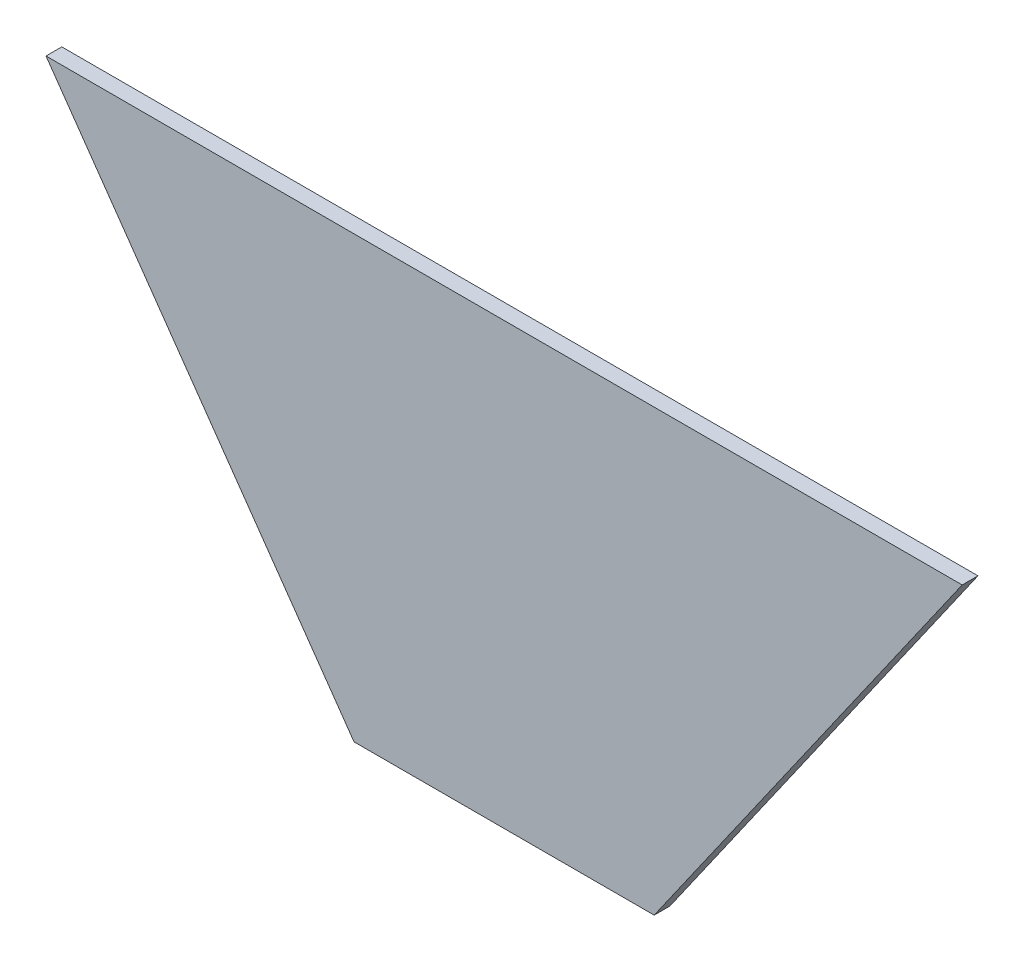
ISO-10303-21;
HEADER;
FILE_DESCRIPTION(('STEP AP214'),'2;1');
FILE_NAME('part.step','',(''),(''),'','','');
FILE_SCHEMA(('AUTOMOTIVE_DESIGN { 1 0 10303 214 1 1 1 1 }'));
ENDSEC;
DATA;
#1=APPLICATION_CONTEXT('core data for automotive mechanical design processes');
#2=APPLICATION_PROTOCOL_DEFINITION('international standard','automotive_design',2000,#1);
#3=PRODUCT_CONTEXT('',#1,'mechanical');
#4=PRODUCT('Part','Part','',(#3));
#5=PRODUCT_RELATED_PRODUCT_CATEGORY('part','',(#4));
#6=PRODUCT_DEFINITION_FORMATION('','',#4);
#7=PRODUCT_DEFINITION_CONTEXT('part definition',#1,'design');
#8=PRODUCT_DEFINITION('design','',#6,#7);
#9=PRODUCT_DEFINITION_SHAPE('','',#8);
#10=(LENGTH_UNIT() NAMED_UNIT(*) SI_UNIT(.MILLI.,.METRE.));
#11=(NAMED_UNIT(*) PLANE_ANGLE_UNIT() SI_UNIT($,.RADIAN.));
#12=(NAMED_UNIT(*) SI_UNIT($,.STERADIAN.) SOLID_ANGLE_UNIT());
#13=UNCERTAINTY_MEASURE_WITH_UNIT(LENGTH_MEASURE(1.E-05),#10,'distance_accuracy_value','');
#14=(GEOMETRIC_REPRESENTATION_CONTEXT(3) GLOBAL_UNCERTAINTY_ASSIGNED_CONTEXT((#13)) GLOBAL_UNIT_ASSIGNED_CONTEXT((#10,
#11,#12)) REPRESENTATION_CONTEXT('',''));
#15=CARTESIAN_POINT('',(0.,0.,0.));
#16=DIRECTION('',(0.,0.,1.));
#17=DIRECTION('',(1.,0.,0.));
#18=AXIS2_PLACEMENT_3D('',#15,#16,#17);
#19=CARTESIAN_POINT('',(-290.,278.522889544109,10.));
#20=DIRECTION('',(0.81918496924738,0.573529411764705,0.));
#21=DIRECTION('',(-0.573529411764705,0.81918496924738,0.));
#22=AXIS2_PLACEMENT_3D('',#19,#20,#21);
#23=PLANE('',#22);
#24=DIRECTION('',(0.573529411764705,-0.81918496924738,0.));
#25=VECTOR('',#24,1.);
#26=CARTESIAN_POINT('',(-290.,278.522889544109,0.));
#27=LINE('',#26,#25);
#28=CARTESIAN_POINT('',(-290.,278.522889544109,0.));
#29=VERTEX_POINT('',#28);
#30=CARTESIAN_POINT('',(-95.,0.,0.));
#31=VERTEX_POINT('',#30);
#32=EDGE_CURVE('E107',#29,#31,#27,.T.);
#33=ORIENTED_EDGE('',*,*,#32,.T.);
#34=DIRECTION('',(0.,0.,-1.));
#35=VECTOR('',#34,1.);
#36=CARTESIAN_POINT('',(-95.,0.,10.));
#37=LINE('',#36,#35);
#38=CARTESIAN_POINT('',(-95.,0.,10.));
#39=VERTEX_POINT('',#38);
#40=EDGE_CURVE('E11',#39,#31,#37,.T.);
#41=ORIENTED_EDGE('',*,*,#40,.F.);
#42=DIRECTION('',(0.573529411764705,-0.81918496924738,0.));
#43=VECTOR('',#42,1.);
#44=CARTESIAN_POINT('',(-290.,278.522889544109,10.));
#45=LINE('',#44,#43);
#46=CARTESIAN_POINT('',(-290.,278.522889544109,10.));
#47=VERTEX_POINT('',#46);
#48=EDGE_CURVE('E91',#47,#39,#45,.T.);
#49=ORIENTED_EDGE('',*,*,#48,.F.);
#50=DIRECTION('',(0.,0.,-1.));
#51=VECTOR('',#50,1.);
#52=CARTESIAN_POINT('',(-290.,278.522889544109,10.));
#53=LINE('',#52,#51);
#54=EDGE_CURVE('E103',#47,#29,#53,.T.);
#55=ORIENTED_EDGE('',*,*,#54,.T.);
#56=EDGE_LOOP('',(#33,#41,#49,#55));
#57=FACE_BOUND('',#56,.T.);
#58=ADVANCED_FACE('F39',(#57),#23,.F.);
#59=CARTESIAN_POINT('',(-95.,0.,10.));
#60=DIRECTION('',(0.,1.,0.));
#61=DIRECTION('',(-1.,0.,0.));
#62=AXIS2_PLACEMENT_3D('',#59,#60,#61);
#63=PLANE('',#62);
#64=DIRECTION('',(1.,0.,0.));
#65=VECTOR('',#64,1.);
#66=CARTESIAN_POINT('',(-95.,0.,0.));
#67=LINE('',#66,#65);
#68=CARTESIAN_POINT('',(95.,0.,0.));
#69=VERTEX_POINT('',#68);
#70=EDGE_CURVE('E96',#31,#69,#67,.T.);
#71=ORIENTED_EDGE('',*,*,#70,.T.);
#72=DIRECTION('',(0.,0.,-1.));
#73=VECTOR('',#72,1.);
#74=CARTESIAN_POINT('',(95.,0.,10.));
#75=LINE('',#74,#73);
#76=CARTESIAN_POINT('',(95.,0.,10.));
#77=VERTEX_POINT('',#76);
#78=EDGE_CURVE('E48',#77,#69,#75,.T.);
#79=ORIENTED_EDGE('',*,*,#78,.F.);
#80=DIRECTION('',(1.,0.,0.));
#81=VECTOR('',#80,1.);
#82=CARTESIAN_POINT('',(-95.,0.,10.));
#83=LINE('',#82,#81);
#84=EDGE_CURVE('E86',#39,#77,#83,.T.);
#85=ORIENTED_EDGE('',*,*,#84,.F.);
#86=ORIENTED_EDGE('',*,*,#40,.T.);
#87=EDGE_LOOP('',(#71,#79,#85,#86));
#88=FACE_BOUND('',#87,.T.);
#89=ADVANCED_FACE('F95',(#88),#63,.F.);
#90=CARTESIAN_POINT('',(95.,0.,10.));
#91=DIRECTION('',(-0.81918496924738,0.573529411764706,0.));
#92=DIRECTION('',(-0.573529411764706,-0.81918496924738,0.));
#93=AXIS2_PLACEMENT_3D('',#90,#91,#92);
#94=PLANE('',#93);
#95=DIRECTION('',(0.573529411764706,0.819184969247379,0.));
#96=VECTOR('',#95,1.);
#97=CARTESIAN_POINT('',(95.,0.,0.));
#98=LINE('',#97,#96);
#99=CARTESIAN_POINT('',(290.,278.522889544109,0.));
#100=VERTEX_POINT('',#99);
#101=EDGE_CURVE('E73',#69,#100,#98,.T.);
#102=ORIENTED_EDGE('',*,*,#101,.T.);
#103=DIRECTION('',(0.,0.,-1.));
#104=VECTOR('',#103,1.);
#105=CARTESIAN_POINT('',(290.,278.522889544109,10.));
#106=LINE('',#105,#104);
#107=CARTESIAN_POINT('',(290.,278.522889544109,10.));
#108=VERTEX_POINT('',#107);
#109=EDGE_CURVE('E98',#108,#100,#106,.T.);
#110=ORIENTED_EDGE('',*,*,#109,.F.);
#111=DIRECTION('',(0.573529411764706,0.819184969247379,0.));
#112=VECTOR('',#111,1.);
#113=CARTESIAN_POINT('',(95.,0.,10.));
#114=LINE('',#113,#112);
#115=EDGE_CURVE('E89',#77,#108,#114,.T.);
#116=ORIENTED_EDGE('',*,*,#115,.F.);
#117=ORIENTED_EDGE('',*,*,#78,.T.);
#118=EDGE_LOOP('',(#102,#110,#116,#117));
#119=FACE_BOUND('',#118,.T.);
#120=ADVANCED_FACE('F99',(#119),#94,.F.);
#121=CARTESIAN_POINT('',(290.,278.522889544109,10.));
#122=DIRECTION('',(0.,-1.,0.));
#123=DIRECTION('',(1.,0.,0.));
#124=AXIS2_PLACEMENT_3D('',#121,#122,#123);
#125=PLANE('',#124);
#126=DIRECTION('',(-1.,0.,0.));
#127=VECTOR('',#126,1.);
#128=CARTESIAN_POINT('',(290.,278.522889544109,0.));
#129=LINE('',#128,#127);
#130=EDGE_CURVE('E79',#100,#29,#129,.T.);
#131=ORIENTED_EDGE('',*,*,#130,.T.);
#132=ORIENTED_EDGE('',*,*,#54,.F.);
#133=DIRECTION('',(-1.,0.,0.));
#134=VECTOR('',#133,1.);
#135=CARTESIAN_POINT('',(290.,278.522889544109,10.));
#136=LINE('',#135,#134);
#137=EDGE_CURVE('E56',#108,#47,#136,.T.);
#138=ORIENTED_EDGE('',*,*,#137,.F.);
#139=ORIENTED_EDGE('',*,*,#109,.T.);
#140=EDGE_LOOP('',(#131,#132,#138,#139));
#141=FACE_BOUND('',#140,.T.);
#142=ADVANCED_FACE('F120',(#141),#125,.F.);
#143=CARTESIAN_POINT('',(0.,0.,10.));
#144=DIRECTION('',(0.,0.,1.));
#145=DIRECTION('',(1.,0.,0.));
#146=AXIS2_PLACEMENT_3D('',#143,#144,#145);
#147=PLANE('',#146);
#148=ORIENTED_EDGE('',*,*,#48,.T.);
#149=ORIENTED_EDGE('',*,*,#84,.T.);
#150=ORIENTED_EDGE('',*,*,#115,.T.);
#151=ORIENTED_EDGE('',*,*,#137,.T.);
#152=EDGE_LOOP('',(#148,#149,#150,#151));
#153=FACE_BOUND('',#152,.T.);
#154=ADVANCED_FACE('F87',(#153),#147,.T.);
#155=CARTESIAN_POINT('',(0.,0.,0.));
#156=DIRECTION('',(0.,0.,1.));
#157=DIRECTION('',(1.,0.,0.));
#158=AXIS2_PLACEMENT_3D('',#155,#156,#157);
#159=PLANE('',#158);
#160=ORIENTED_EDGE('',*,*,#32,.F.);
#161=ORIENTED_EDGE('',*,*,#130,.F.);
#162=ORIENTED_EDGE('',*,*,#101,.F.);
#163=ORIENTED_EDGE('',*,*,#70,.F.);
#164=EDGE_LOOP('',(#160,#161,#162,#163));
#165=FACE_BOUND('',#164,.T.);
#166=ADVANCED_FACE('F123',(#165),#159,.F.);
#167=CLOSED_SHELL('',(#58,#89,#120,#142,#154,#166));
#168=MANIFOLD_SOLID_BREP('B2',#167);
#169=ADVANCED_BREP_SHAPE_REPRESENTATION('',(#18,#168),#14);
#170=SHAPE_DEFINITION_REPRESENTATION(#9,#169);
ENDSEC;
END-ISO-10303-21;
